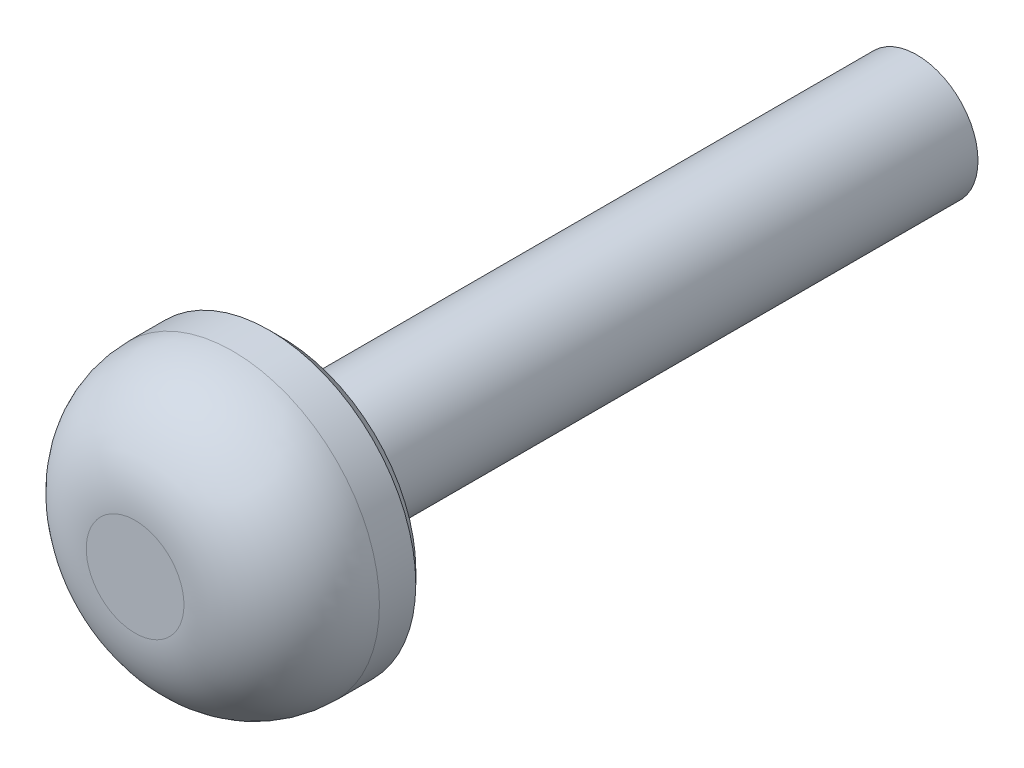
ISO-10303-21;
HEADER;
FILE_DESCRIPTION(('STEP AP214'),'2;1');
FILE_NAME('part.step','',(''),(''),'','','');
FILE_SCHEMA(('AUTOMOTIVE_DESIGN { 1 0 10303 214 1 1 1 1 }'));
ENDSEC;
DATA;
#1=APPLICATION_CONTEXT('core data for automotive mechanical design processes');
#2=APPLICATION_PROTOCOL_DEFINITION('international standard','automotive_design',2000,#1);
#3=PRODUCT_CONTEXT('',#1,'mechanical');
#4=PRODUCT('Part','Part','',(#3));
#5=PRODUCT_RELATED_PRODUCT_CATEGORY('part','',(#4));
#6=PRODUCT_DEFINITION_FORMATION('','',#4);
#7=PRODUCT_DEFINITION_CONTEXT('part definition',#1,'design');
#8=PRODUCT_DEFINITION('design','',#6,#7);
#9=PRODUCT_DEFINITION_SHAPE('','',#8);
#10=(LENGTH_UNIT() NAMED_UNIT(*) SI_UNIT(.MILLI.,.METRE.));
#11=(NAMED_UNIT(*) PLANE_ANGLE_UNIT() SI_UNIT($,.RADIAN.));
#12=(NAMED_UNIT(*) SI_UNIT($,.STERADIAN.) SOLID_ANGLE_UNIT());
#13=UNCERTAINTY_MEASURE_WITH_UNIT(LENGTH_MEASURE(1.E-05),#10,'distance_accuracy_value','');
#14=(GEOMETRIC_REPRESENTATION_CONTEXT(3) GLOBAL_UNCERTAINTY_ASSIGNED_CONTEXT((#13)) GLOBAL_UNIT_ASSIGNED_CONTEXT((#10,
#11,#12)) REPRESENTATION_CONTEXT('',''));
#15=CARTESIAN_POINT('',(0.,0.,0.));
#16=DIRECTION('',(0.,0.,1.));
#17=DIRECTION('',(1.,0.,0.));
#18=AXIS2_PLACEMENT_3D('',#15,#16,#17);
#19=CARTESIAN_POINT('',(0.,0.,16.));
#20=DIRECTION('',(0.,0.,-1.));
#21=DIRECTION('',(-1.,0.,0.));
#22=AXIS2_PLACEMENT_3D('',#19,#20,#21);
#23=CYLINDRICAL_SURFACE('',#22,1.25);
#24=CARTESIAN_POINT('',(0.,0.,0.));
#25=DIRECTION('',(0.,0.,1.));
#26=DIRECTION('',(1.,0.,0.));
#27=AXIS2_PLACEMENT_3D('',#24,#25,#26);
#28=CIRCLE('',#27,1.25);
#29=CARTESIAN_POINT('',(1.25,0.,0.));
#30=VERTEX_POINT('',#29);
#31=EDGE_CURVE('E57',#30,#30,#28,.T.);
#32=ORIENTED_EDGE('',*,*,#31,.T.);
#33=EDGE_LOOP('',(#32));
#34=FACE_BOUND('',#33,.T.);
#35=CARTESIAN_POINT('',(0.,0.,13.));
#36=DIRECTION('',(0.,0.,1.));
#37=DIRECTION('',(1.,0.,0.));
#38=AXIS2_PLACEMENT_3D('',#35,#36,#37);
#39=CIRCLE('',#38,1.25);
#40=CARTESIAN_POINT('',(1.25,0.,13.));
#41=VERTEX_POINT('',#40);
#42=EDGE_CURVE('E54',#41,#41,#39,.T.);
#43=ORIENTED_EDGE('',*,*,#42,.F.);
#44=EDGE_LOOP('',(#43));
#45=FACE_BOUND('',#44,.T.);
#46=ADVANCED_FACE('F34',(#34,#45),#23,.T.);
#47=CARTESIAN_POINT('',(0.,0.,0.));
#48=DIRECTION('',(0.,0.,1.));
#49=DIRECTION('',(1.,0.,0.));
#50=AXIS2_PLACEMENT_3D('',#47,#48,#49);
#51=PLANE('',#50);
#52=ORIENTED_EDGE('',*,*,#31,.F.);
#53=EDGE_LOOP('',(#52));
#54=FACE_BOUND('',#53,.T.);
#55=ADVANCED_FACE('F63',(#54),#51,.F.);
#56=CARTESIAN_POINT('',(0.,0.,13.));
#57=DIRECTION('',(0.,0.,1.));
#58=DIRECTION('',(1.,0.,0.));
#59=AXIS2_PLACEMENT_3D('',#56,#57,#58);
#60=CYLINDRICAL_SURFACE('',#59,3.);
#61=CARTESIAN_POINT('',(0.,0.,13.256));
#62=DIRECTION('',(0.,0.,1.));
#63=DIRECTION('',(1.,0.,0.));
#64=AXIS2_PLACEMENT_3D('',#61,#62,#63);
#65=CIRCLE('',#64,3.);
#66=CARTESIAN_POINT('',(3.,0.,13.256));
#67=VERTEX_POINT('',#66);
#68=EDGE_CURVE('E41',#67,#67,#65,.T.);
#69=ORIENTED_EDGE('',*,*,#68,.T.);
#70=EDGE_LOOP('',(#69));
#71=FACE_BOUND('',#70,.T.);
#72=CARTESIAN_POINT('',(0.,0.,14.));
#73=DIRECTION('',(0.,0.,1.));
#74=DIRECTION('',(1.,0.,0.));
#75=AXIS2_PLACEMENT_3D('',#72,#73,#74);
#76=CIRCLE('',#75,3.);
#77=CARTESIAN_POINT('',(3.,0.,14.));
#78=VERTEX_POINT('',#77);
#79=EDGE_CURVE('E45',#78,#78,#76,.F.);
#80=ORIENTED_EDGE('',*,*,#79,.T.);
#81=EDGE_LOOP('',(#80));
#82=FACE_BOUND('',#81,.T.);
#83=ADVANCED_FACE('F65',(#71,#82),#60,.T.);
#84=CARTESIAN_POINT('',(0.,0.,13.));
#85=DIRECTION('',(0.,0.,1.));
#86=DIRECTION('',(1.,0.,0.));
#87=AXIS2_PLACEMENT_3D('',#84,#85,#86);
#88=PLANE('',#87);
#89=CARTESIAN_POINT('',(0.,0.,13.));
#90=DIRECTION('',(0.,0.,1.));
#91=DIRECTION('',(1.,0.,0.));
#92=AXIS2_PLACEMENT_3D('',#89,#90,#91);
#93=CIRCLE('',#92,2.744);
#94=CARTESIAN_POINT('',(2.744,0.,13.));
#95=VERTEX_POINT('',#94);
#96=EDGE_CURVE('E10',#95,#95,#93,.F.);
#97=ORIENTED_EDGE('',*,*,#96,.T.);
#98=EDGE_LOOP('',(#97));
#99=FACE_BOUND('',#98,.T.);
#100=ORIENTED_EDGE('',*,*,#42,.T.);
#101=EDGE_LOOP('',(#100));
#102=FACE_BOUND('',#101,.T.);
#103=ADVANCED_FACE('F71',(#99,#102),#88,.F.);
#104=CARTESIAN_POINT('',(0.,0.,16.));
#105=DIRECTION('',(0.,0.,1.));
#106=DIRECTION('',(1.,0.,0.));
#107=AXIS2_PLACEMENT_3D('',#104,#105,#106);
#108=PLANE('',#107);
#109=CARTESIAN_POINT('',(0.,0.,16.));
#110=DIRECTION('',(0.,0.,1.));
#111=DIRECTION('',(1.,0.,0.));
#112=AXIS2_PLACEMENT_3D('',#109,#110,#111);
#113=CIRCLE('',#112,1.);
#114=CARTESIAN_POINT('',(1.,0.,16.));
#115=VERTEX_POINT('',#114);
#116=EDGE_CURVE('E49',#115,#115,#113,.T.);
#117=ORIENTED_EDGE('',*,*,#116,.T.);
#118=EDGE_LOOP('',(#117));
#119=FACE_BOUND('',#118,.T.);
#120=ADVANCED_FACE('F75',(#119),#108,.T.);
#121=CARTESIAN_POINT('',(0.,0.,14.));
#122=DIRECTION('',(0.,0.,1.));
#123=DIRECTION('',(1.,0.,0.));
#124=AXIS2_PLACEMENT_3D('',#121,#122,#123);
#125=DEGENERATE_TOROIDAL_SURFACE('',#124,1.,2.,.T.);
#126=ORIENTED_EDGE('',*,*,#79,.F.);
#127=EDGE_LOOP('',(#126));
#128=FACE_BOUND('',#127,.T.);
#129=ORIENTED_EDGE('',*,*,#116,.F.);
#130=EDGE_LOOP('',(#129));
#131=FACE_BOUND('',#130,.T.);
#132=ADVANCED_FACE('F76',(#128,#131),#125,.T.);
#133=CARTESIAN_POINT('',(0.,0.,13.256));
#134=DIRECTION('',(0.,0.,1.));
#135=DIRECTION('',(1.,0.,0.));
#136=AXIS2_PLACEMENT_3D('',#133,#134,#135);
#137=CONICAL_SURFACE('',#136,3.,0.785398163397454);
#138=ORIENTED_EDGE('',*,*,#96,.F.);
#139=EDGE_LOOP('',(#138));
#140=FACE_BOUND('',#139,.T.);
#141=ORIENTED_EDGE('',*,*,#68,.F.);
#142=EDGE_LOOP('',(#141));
#143=FACE_BOUND('',#142,.T.);
#144=ADVANCED_FACE('F36',(#140,#143),#137,.T.);
#145=CLOSED_SHELL('',(#46,#55,#83,#103,#120,#132,#144));
#146=MANIFOLD_SOLID_BREP('B2',#145);
#147=ADVANCED_BREP_SHAPE_REPRESENTATION('',(#18,#146),#14);
#148=SHAPE_DEFINITION_REPRESENTATION(#9,#147);
ENDSEC;
END-ISO-10303-21;
